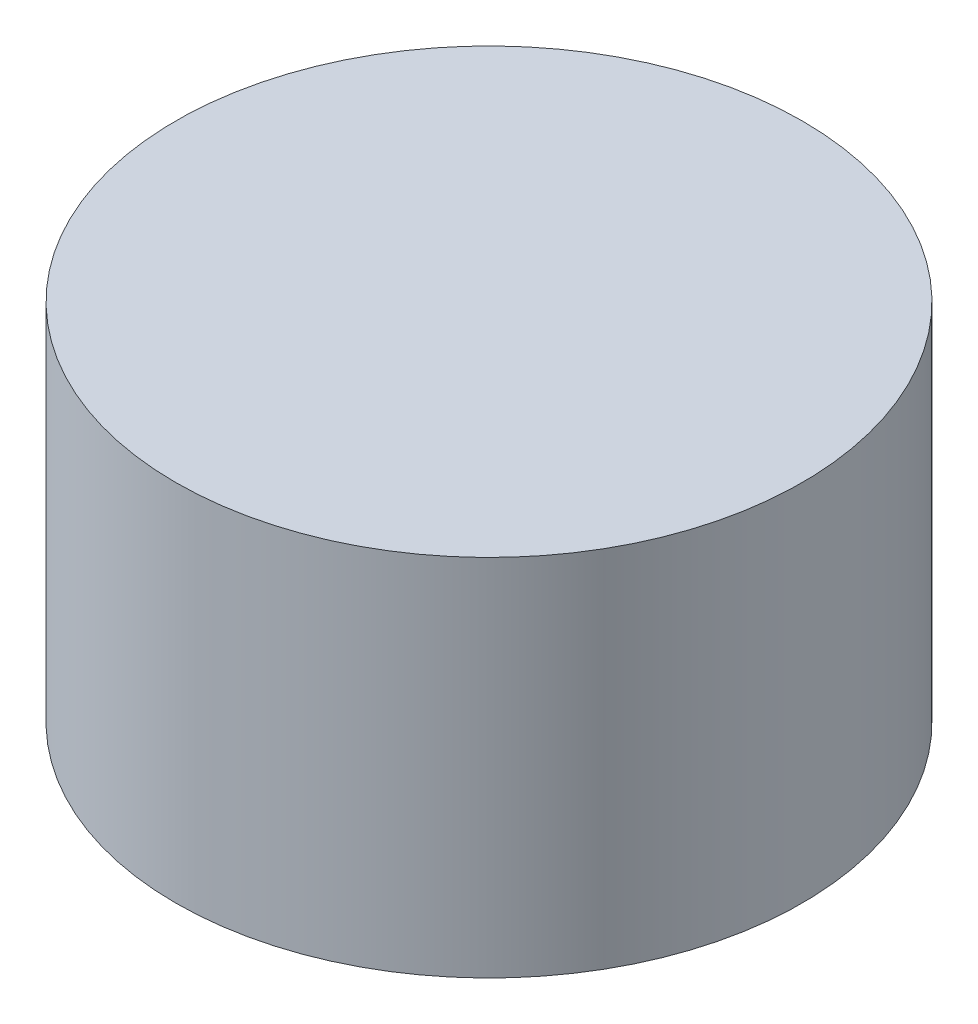
ISO-10303-21;
HEADER;
FILE_DESCRIPTION(('STEP AP214'),'2;1');
FILE_NAME('part.step','',(''),(''),'','','');
FILE_SCHEMA(('AUTOMOTIVE_DESIGN { 1 0 10303 214 1 1 1 1 }'));
ENDSEC;
DATA;
#1=APPLICATION_CONTEXT('core data for automotive mechanical design processes');
#2=APPLICATION_PROTOCOL_DEFINITION('international standard','automotive_design',2000,#1);
#3=PRODUCT_CONTEXT('',#1,'mechanical');
#4=PRODUCT('Part','Part','',(#3));
#5=PRODUCT_RELATED_PRODUCT_CATEGORY('part','',(#4));
#6=PRODUCT_DEFINITION_FORMATION('','',#4);
#7=PRODUCT_DEFINITION_CONTEXT('part definition',#1,'design');
#8=PRODUCT_DEFINITION('design','',#6,#7);
#9=PRODUCT_DEFINITION_SHAPE('','',#8);
#10=(LENGTH_UNIT() NAMED_UNIT(*) SI_UNIT(.MILLI.,.METRE.));
#11=(NAMED_UNIT(*) PLANE_ANGLE_UNIT() SI_UNIT($,.RADIAN.));
#12=(NAMED_UNIT(*) SI_UNIT($,.STERADIAN.) SOLID_ANGLE_UNIT());
#13=UNCERTAINTY_MEASURE_WITH_UNIT(LENGTH_MEASURE(1.E-05),#10,'distance_accuracy_value','');
#14=(GEOMETRIC_REPRESENTATION_CONTEXT(3) GLOBAL_UNCERTAINTY_ASSIGNED_CONTEXT((#13)) GLOBAL_UNIT_ASSIGNED_CONTEXT((#10,
#11,#12)) REPRESENTATION_CONTEXT('',''));
#15=CARTESIAN_POINT('',(0.,0.,0.));
#16=DIRECTION('',(0.,0.,1.));
#17=DIRECTION('',(1.,0.,0.));
#18=AXIS2_PLACEMENT_3D('',#15,#16,#17);
#19=CARTESIAN_POINT('',(0.,2.5,0.));
#20=DIRECTION('',(0.,-1.,0.));
#21=DIRECTION('',(0.,0.,-1.));
#22=AXIS2_PLACEMENT_3D('',#19,#20,#21);
#23=CYLINDRICAL_SURFACE('',#22,2.15);
#24=CARTESIAN_POINT('',(0.,2.5,0.));
#25=DIRECTION('',(0.,1.,0.));
#26=DIRECTION('',(0.,0.,1.));
#27=AXIS2_PLACEMENT_3D('',#24,#25,#26);
#28=CIRCLE('',#27,2.15);
#29=CARTESIAN_POINT('',(0.,2.5,2.15));
#30=VERTEX_POINT('',#29);
#31=EDGE_CURVE('E10',#30,#30,#28,.T.);
#32=ORIENTED_EDGE('',*,*,#31,.F.);
#33=EDGE_LOOP('',(#32));
#34=FACE_BOUND('',#33,.T.);
#35=CARTESIAN_POINT('',(0.,0.,0.));
#36=DIRECTION('',(0.,1.,0.));
#37=DIRECTION('',(0.,0.,1.));
#38=AXIS2_PLACEMENT_3D('',#35,#36,#37);
#39=CIRCLE('',#38,2.15);
#40=CARTESIAN_POINT('',(0.,0.,2.15));
#41=VERTEX_POINT('',#40);
#42=EDGE_CURVE('E42',#41,#41,#39,.T.);
#43=ORIENTED_EDGE('',*,*,#42,.T.);
#44=EDGE_LOOP('',(#43));
#45=FACE_BOUND('',#44,.T.);
#46=ADVANCED_FACE('F39',(#34,#45),#23,.T.);
#47=CARTESIAN_POINT('',(0.,2.5,0.));
#48=DIRECTION('',(0.,1.,0.));
#49=DIRECTION('',(0.,0.,1.));
#50=AXIS2_PLACEMENT_3D('',#47,#48,#49);
#51=PLANE('',#50);
#52=ORIENTED_EDGE('',*,*,#31,.T.);
#53=EDGE_LOOP('',(#52));
#54=FACE_BOUND('',#53,.T.);
#55=ADVANCED_FACE('F54',(#54),#51,.T.);
#56=CARTESIAN_POINT('',(0.,0.,0.));
#57=DIRECTION('',(0.,1.,0.));
#58=DIRECTION('',(0.,0.,1.));
#59=AXIS2_PLACEMENT_3D('',#56,#57,#58);
#60=PLANE('',#59);
#61=ORIENTED_EDGE('',*,*,#42,.F.);
#62=EDGE_LOOP('',(#61));
#63=FACE_BOUND('',#62,.T.);
#64=ADVANCED_FACE('F52',(#63),#60,.F.);
#65=CLOSED_SHELL('',(#46,#55,#64));
#66=MANIFOLD_SOLID_BREP('B2',#65);
#67=ADVANCED_BREP_SHAPE_REPRESENTATION('',(#18,#66),#14);
#68=SHAPE_DEFINITION_REPRESENTATION(#9,#67);
ENDSEC;
END-ISO-10303-21;
